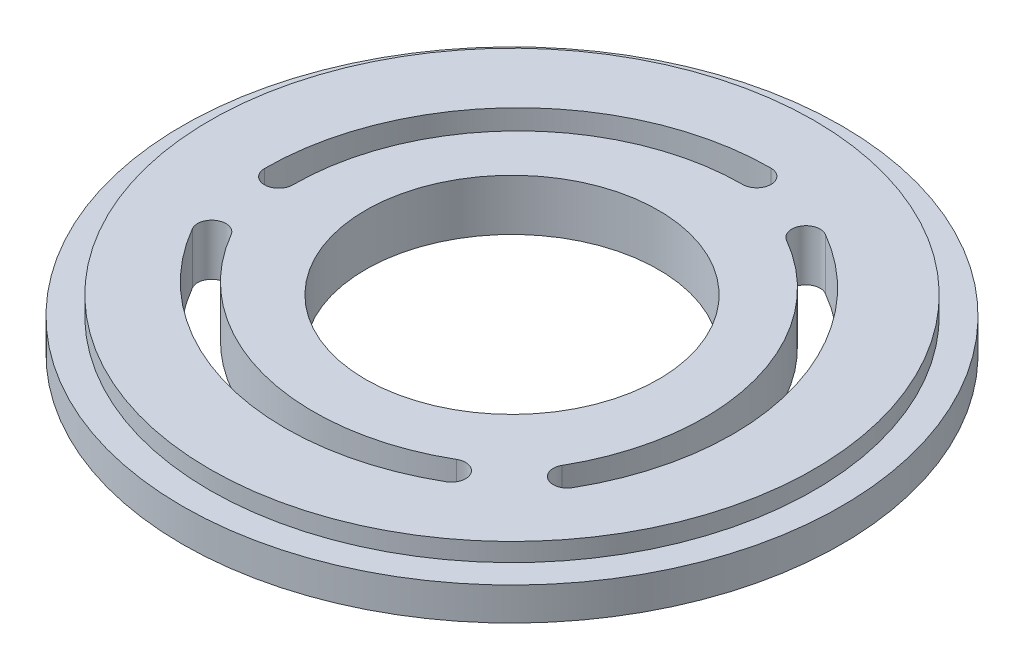
ISO-10303-21;
HEADER;
FILE_DESCRIPTION(('STEP AP214'),'2;1');
FILE_NAME('part.step','',(''),(''),'','','');
FILE_SCHEMA(('AUTOMOTIVE_DESIGN { 1 0 10303 214 1 1 1 1 }'));
ENDSEC;
DATA;
#1=APPLICATION_CONTEXT('core data for automotive mechanical design processes');
#2=APPLICATION_PROTOCOL_DEFINITION('international standard','automotive_design',2000,#1);
#3=PRODUCT_CONTEXT('',#1,'mechanical');
#4=PRODUCT('Part','Part','',(#3));
#5=PRODUCT_RELATED_PRODUCT_CATEGORY('part','',(#4));
#6=PRODUCT_DEFINITION_FORMATION('','',#4);
#7=PRODUCT_DEFINITION_CONTEXT('part definition',#1,'design');
#8=PRODUCT_DEFINITION('design','',#6,#7);
#9=PRODUCT_DEFINITION_SHAPE('','',#8);
#10=(LENGTH_UNIT() NAMED_UNIT(*) SI_UNIT(.MILLI.,.METRE.));
#11=(NAMED_UNIT(*) PLANE_ANGLE_UNIT() SI_UNIT($,.RADIAN.));
#12=(NAMED_UNIT(*) SI_UNIT($,.STERADIAN.) SOLID_ANGLE_UNIT());
#13=UNCERTAINTY_MEASURE_WITH_UNIT(LENGTH_MEASURE(1.E-05),#10,'distance_accuracy_value','');
#14=(GEOMETRIC_REPRESENTATION_CONTEXT(3) GLOBAL_UNCERTAINTY_ASSIGNED_CONTEXT((#13)) GLOBAL_UNIT_ASSIGNED_CONTEXT((#10,
#11,#12)) REPRESENTATION_CONTEXT('',''));
#15=CARTESIAN_POINT('',(0.,0.,0.));
#16=DIRECTION('',(0.,0.,1.));
#17=DIRECTION('',(1.,0.,0.));
#18=AXIS2_PLACEMENT_3D('',#15,#16,#17);
#19=CARTESIAN_POINT('',(0.,-1.8,0.));
#20=DIRECTION('',(0.,1.,0.));
#21=DIRECTION('',(0.,0.,1.));
#22=AXIS2_PLACEMENT_3D('',#19,#20,#21);
#23=CYLINDRICAL_SURFACE('',#22,18.);
#24=CARTESIAN_POINT('',(0.,-1.8,0.));
#25=DIRECTION('',(0.,1.,0.));
#26=DIRECTION('',(0.,0.,1.));
#27=AXIS2_PLACEMENT_3D('',#24,#25,#26);
#28=CIRCLE('',#27,18.);
#29=CARTESIAN_POINT('',(0.,-1.8,18.));
#30=VERTEX_POINT('',#29);
#31=EDGE_CURVE('E52',#30,#30,#28,.T.);
#32=ORIENTED_EDGE('',*,*,#31,.T.);
#33=EDGE_LOOP('',(#32));
#34=FACE_BOUND('',#33,.T.);
#35=CARTESIAN_POINT('',(0.,0.,0.));
#36=DIRECTION('',(0.,1.,0.));
#37=DIRECTION('',(0.,0.,1.));
#38=AXIS2_PLACEMENT_3D('',#35,#36,#37);
#39=CIRCLE('',#38,18.);
#40=CARTESIAN_POINT('',(0.,0.,18.));
#41=VERTEX_POINT('',#40);
#42=EDGE_CURVE('E46',#41,#41,#39,.T.);
#43=ORIENTED_EDGE('',*,*,#42,.F.);
#44=EDGE_LOOP('',(#43));
#45=FACE_BOUND('',#44,.T.);
#46=ADVANCED_FACE('F43',(#34,#45),#23,.T.);
#47=CARTESIAN_POINT('',(0.,-1.8,0.));
#48=DIRECTION('',(0.,1.,0.));
#49=DIRECTION('',(0.,0.,1.));
#50=AXIS2_PLACEMENT_3D('',#47,#48,#49);
#51=PLANE('',#50);
#52=CARTESIAN_POINT('',(-1.20958056797005,-1.8,0.567295138495359));
#53=DIRECTION('',(0.,1.,0.));
#54=DIRECTION('',(0.,0.,1.));
#55=AXIS2_PLACEMENT_3D('',#52,#53,#54);
#56=CIRCLE('',#55,12.2830345810914);
#57=CARTESIAN_POINT('',(4.91644636083585,-1.8,-10.0790531832454));
#58=VERTEX_POINT('',#57);
#59=CARTESIAN_POINT('',(9.43676775377074,-1.8,6.69332206730114));
#60=VERTEX_POINT('',#59);
#61=EDGE_CURVE('E259',#58,#60,#56,.F.);
#62=ORIENTED_EDGE('',*,*,#61,.T.);
#63=CARTESIAN_POINT('',(10.1080465638795,-1.8,7.07958334141947));
#64=DIRECTION('',(0.,1.,0.));
#65=DIRECTION('',(0.,0.,1.));
#66=AXIS2_PLACEMENT_3D('',#63,#64,#65);
#67=CIRCLE('',#66,0.774475960107598);
#68=CARTESIAN_POINT('',(10.7793253739883,-1.8,7.4658446155378));
#69=VERTEX_POINT('',#68);
#70=EDGE_CURVE('E263',#60,#69,#67,.T.);
#71=ORIENTED_EDGE('',*,*,#70,.T.);
#72=CARTESIAN_POINT('',(-1.20958056797005,-1.8,0.567295138495359));
#73=DIRECTION('',(0.,1.,0.));
#74=DIRECTION('',(0.,0.,1.));
#75=AXIS2_PLACEMENT_3D('',#72,#73,#74);
#76=CIRCLE('',#75,13.8319865013066);
#77=CARTESIAN_POINT('',(5.68896890907253,-1.8,-11.4216108034629));
#78=VERTEX_POINT('',#77);
#79=EDGE_CURVE('E251',#69,#78,#76,.T.);
#80=ORIENTED_EDGE('',*,*,#79,.T.);
#81=CARTESIAN_POINT('',(5.30270763495419,-1.8,-10.7503319933541));
#82=DIRECTION('',(0.,1.,0.));
#83=DIRECTION('',(0.,0.,1.));
#84=AXIS2_PLACEMENT_3D('',#81,#82,#83);
#85=CIRCLE('',#84,0.774475960107599);
#86=EDGE_CURVE('E255',#78,#58,#85,.T.);
#87=ORIENTED_EDGE('',*,*,#86,.T.);
#88=EDGE_LOOP('',(#62,#71,#80,#87));
#89=FACE_BOUND('',#88,.T.);
#90=CARTESIAN_POINT('',(0.113498282604641,-1.8,-1.33117506903375));
#91=DIRECTION('',(0.,1.,0.));
#92=DIRECTION('',(0.,0.,1.));
#93=AXIS2_PLACEMENT_3D('',#90,#91,#92);
#94=CIRCLE('',#93,12.2830345810914);
#95=CARTESIAN_POINT('',(6.27049292236693,-1.8,9.29729403645011));
#96=VERTEX_POINT('',#95);
#97=CARTESIAN_POINT('',(-10.5149708228792,-1.8,4.82581957072865));
#98=VERTEX_POINT('',#97);
#99=EDGE_CURVE('E246',#96,#98,#94,.F.);
#100=ORIENTED_EDGE('',*,*,#99,.T.);
#101=CARTESIAN_POINT('',(-11.1851223038182,-1.8,5.21403343624589));
#102=DIRECTION('',(0.,1.,0.));
#103=DIRECTION('',(0.,0.,1.));
#104=AXIS2_PLACEMENT_3D('',#101,#102,#103);
#105=CIRCLE('',#104,0.774475960107598);
#106=CARTESIAN_POINT('',(-11.8552737847572,-1.8,5.60224730176312));
#107=VERTEX_POINT('',#106);
#108=EDGE_CURVE('E141',#98,#107,#105,.T.);
#109=ORIENTED_EDGE('',*,*,#108,.T.);
#110=CARTESIAN_POINT('',(0.113498282604641,-1.8,-1.33117506903375));
#111=DIRECTION('',(0.,1.,0.));
#112=DIRECTION('',(0.,0.,1.));
#113=AXIS2_PLACEMENT_3D('',#110,#111,#112);
#114=CIRCLE('',#113,13.8319865013066);
#115=CARTESIAN_POINT('',(7.04692065340138,-1.8,10.6375969983281));
#116=VERTEX_POINT('',#115);
#117=EDGE_CURVE('E238',#107,#116,#114,.T.);
#118=ORIENTED_EDGE('',*,*,#117,.T.);
#119=CARTESIAN_POINT('',(6.65870678788415,-1.8,9.96744551738913));
#120=DIRECTION('',(0.,1.,0.));
#121=DIRECTION('',(0.,0.,1.));
#122=AXIS2_PLACEMENT_3D('',#119,#120,#121);
#123=CIRCLE('',#122,0.774475960107599);
#124=EDGE_CURVE('E242',#116,#96,#123,.T.);
#125=ORIENTED_EDGE('',*,*,#124,.T.);
#126=EDGE_LOOP('',(#100,#109,#118,#125));
#127=FACE_BOUND('',#126,.T.);
#128=CARTESIAN_POINT('',(1.09608228536542,-1.8,0.763879930538391));
#129=DIRECTION('',(0.,1.,0.));
#130=DIRECTION('',(0.,0.,1.));
#131=AXIS2_PLACEMENT_3D('',#128,#129,#130);
#132=CIRCLE('',#131,12.2830345810914);
#133=CARTESIAN_POINT('',(-11.1869392832028,-1.8,0.78175914679533));
#134=VERTEX_POINT('',#133);
#135=CARTESIAN_POINT('',(1.07820306910834,-1.8,-11.5191416380298));
#136=VERTEX_POINT('',#135);
#137=EDGE_CURVE('E230',#134,#136,#132,.F.);
#138=ORIENTED_EDGE('',*,*,#137,.T.);
#139=CARTESIAN_POINT('',(1.07707573993856,-1.8,-12.2936167776654));
#140=DIRECTION('',(0.,1.,0.));
#141=DIRECTION('',(0.,0.,1.));
#142=AXIS2_PLACEMENT_3D('',#139,#140,#141);
#143=CIRCLE('',#142,0.774475960107599);
#144=CARTESIAN_POINT('',(1.07594841076878,-1.8,-13.068091917301));
#145=VERTEX_POINT('',#144);
#146=EDGE_CURVE('E234',#136,#145,#143,.T.);
#147=ORIENTED_EDGE('',*,*,#146,.T.);
#148=CARTESIAN_POINT('',(1.09608228536542,-1.8,0.763879930538391));
#149=DIRECTION('',(0.,1.,0.));
#150=DIRECTION('',(0.,0.,1.));
#151=AXIS2_PLACEMENT_3D('',#148,#149,#150);
#152=CIRCLE('',#151,13.8319865013066);
#153=CARTESIAN_POINT('',(-12.735889562474,-1.8,0.784013805134867));
#154=VERTEX_POINT('',#153);
#155=EDGE_CURVE('E213',#145,#154,#152,.T.);
#156=ORIENTED_EDGE('',*,*,#155,.T.);
#157=CARTESIAN_POINT('',(-11.9614144228384,-1.8,0.782886475965101));
#158=DIRECTION('',(0.,1.,0.));
#159=DIRECTION('',(0.,0.,1.));
#160=AXIS2_PLACEMENT_3D('',#157,#158,#159);
#161=CIRCLE('',#160,0.774475960107599);
#162=EDGE_CURVE('E226',#154,#134,#161,.T.);
#163=ORIENTED_EDGE('',*,*,#162,.T.);
#164=EDGE_LOOP('',(#138,#147,#156,#163));
#165=FACE_BOUND('',#164,.T.);
#166=CARTESIAN_POINT('',(0.,-1.8,0.));
#167=DIRECTION('',(0.,1.,0.));
#168=DIRECTION('',(0.,0.,1.));
#169=AXIS2_PLACEMENT_3D('',#166,#167,#168);
#170=CIRCLE('',#169,8.);
#171=CARTESIAN_POINT('',(0.,-1.8,8.));
#172=VERTEX_POINT('',#171);
#173=EDGE_CURVE('E271',#172,#172,#170,.T.);
#174=ORIENTED_EDGE('',*,*,#173,.T.);
#175=EDGE_LOOP('',(#174));
#176=FACE_BOUND('',#175,.T.);
#177=ORIENTED_EDGE('',*,*,#31,.F.);
#178=EDGE_LOOP('',(#177));
#179=FACE_BOUND('',#178,.T.);
#180=ADVANCED_FACE('F289',(#89,#127,#165,#176,#179),#51,.F.);
#181=CARTESIAN_POINT('',(0.,0.,0.));
#182=DIRECTION('',(0.,1.,0.));
#183=DIRECTION('',(0.,0.,1.));
#184=AXIS2_PLACEMENT_3D('',#181,#182,#183);
#185=PLANE('',#184);
#186=CARTESIAN_POINT('',(0.,0.,0.));
#187=DIRECTION('',(0.,1.,0.));
#188=DIRECTION('',(0.,0.,1.));
#189=AXIS2_PLACEMENT_3D('',#186,#187,#188);
#190=CIRCLE('',#189,16.5);
#191=CARTESIAN_POINT('',(0.,0.,16.5));
#192=VERTEX_POINT('',#191);
#193=EDGE_CURVE('E11',#192,#192,#190,.T.);
#194=ORIENTED_EDGE('',*,*,#193,.F.);
#195=EDGE_LOOP('',(#194));
#196=FACE_BOUND('',#195,.T.);
#197=ORIENTED_EDGE('',*,*,#42,.T.);
#198=EDGE_LOOP('',(#197));
#199=FACE_BOUND('',#198,.T.);
#200=ADVANCED_FACE('F286',(#196,#199),#185,.T.);
#201=CARTESIAN_POINT('',(0.,1.,0.));
#202=DIRECTION('',(0.,-1.,0.));
#203=DIRECTION('',(0.,0.,-1.));
#204=AXIS2_PLACEMENT_3D('',#201,#202,#203);
#205=CYLINDRICAL_SURFACE('',#204,16.5);
#206=CARTESIAN_POINT('',(0.,1.,0.));
#207=DIRECTION('',(0.,1.,0.));
#208=DIRECTION('',(0.,0.,1.));
#209=AXIS2_PLACEMENT_3D('',#206,#207,#208);
#210=CIRCLE('',#209,16.5);
#211=CARTESIAN_POINT('',(0.,1.,16.5));
#212=VERTEX_POINT('',#211);
#213=EDGE_CURVE('E275',#212,#212,#210,.T.);
#214=ORIENTED_EDGE('',*,*,#213,.F.);
#215=EDGE_LOOP('',(#214));
#216=FACE_BOUND('',#215,.T.);
#217=ORIENTED_EDGE('',*,*,#193,.T.);
#218=EDGE_LOOP('',(#217));
#219=FACE_BOUND('',#218,.T.);
#220=ADVANCED_FACE('F298',(#216,#219),#205,.T.);
#221=CARTESIAN_POINT('',(0.,1.,0.));
#222=DIRECTION('',(0.,1.,0.));
#223=DIRECTION('',(0.,0.,1.));
#224=AXIS2_PLACEMENT_3D('',#221,#222,#223);
#225=PLANE('',#224);
#226=CARTESIAN_POINT('',(10.1080465638795,1.,7.07958334141947));
#227=DIRECTION('',(0.,1.,0.));
#228=DIRECTION('',(0.,0.,1.));
#229=AXIS2_PLACEMENT_3D('',#226,#227,#228);
#230=CIRCLE('',#229,0.774475960107598);
#231=CARTESIAN_POINT('',(9.43676775377074,1.,6.69332206730114));
#232=VERTEX_POINT('',#231);
#233=CARTESIAN_POINT('',(10.7793253739883,1.,7.4658446155378));
#234=VERTEX_POINT('',#233);
#235=EDGE_CURVE('E191',#232,#234,#230,.T.);
#236=ORIENTED_EDGE('',*,*,#235,.F.);
#237=CARTESIAN_POINT('',(-1.20958056797005,1.,0.567295138495359));
#238=DIRECTION('',(0.,-1.,0.));
#239=DIRECTION('',(0.,0.,1.));
#240=AXIS2_PLACEMENT_3D('',#237,#238,#239);
#241=CIRCLE('',#240,12.2830345810914);
#242=CARTESIAN_POINT('',(4.91644636083585,1.,-10.0790531832454));
#243=VERTEX_POINT('',#242);
#244=EDGE_CURVE('E176',#243,#232,#241,.T.);
#245=ORIENTED_EDGE('',*,*,#244,.F.);
#246=CARTESIAN_POINT('',(5.30270763495419,1.,-10.7503319933541));
#247=DIRECTION('',(0.,1.,0.));
#248=DIRECTION('',(0.,0.,1.));
#249=AXIS2_PLACEMENT_3D('',#246,#247,#248);
#250=CIRCLE('',#249,0.774475960107599);
#251=CARTESIAN_POINT('',(5.68896890907253,1.,-11.4216108034629));
#252=VERTEX_POINT('',#251);
#253=EDGE_CURVE('E184',#252,#243,#250,.T.);
#254=ORIENTED_EDGE('',*,*,#253,.F.);
#255=CARTESIAN_POINT('',(-1.20958056797005,1.,0.567295138495359));
#256=DIRECTION('',(0.,1.,0.));
#257=DIRECTION('',(0.,0.,1.));
#258=AXIS2_PLACEMENT_3D('',#255,#256,#257);
#259=CIRCLE('',#258,13.8319865013066);
#260=EDGE_CURVE('E188',#234,#252,#259,.T.);
#261=ORIENTED_EDGE('',*,*,#260,.F.);
#262=EDGE_LOOP('',(#236,#245,#254,#261));
#263=FACE_BOUND('',#262,.T.);
#264=CARTESIAN_POINT('',(-11.1851223038182,1.,5.21403343624589));
#265=DIRECTION('',(0.,1.,0.));
#266=DIRECTION('',(0.,0.,1.));
#267=AXIS2_PLACEMENT_3D('',#264,#265,#266);
#268=CIRCLE('',#267,0.774475960107598);
#269=CARTESIAN_POINT('',(-10.5149708228792,1.,4.82581957072865));
#270=VERTEX_POINT('',#269);
#271=CARTESIAN_POINT('',(-11.8552737847572,1.,5.60224730176312));
#272=VERTEX_POINT('',#271);
#273=EDGE_CURVE('E138',#270,#272,#268,.T.);
#274=ORIENTED_EDGE('',*,*,#273,.F.);
#275=CARTESIAN_POINT('',(0.113498282604641,1.,-1.33117506903375));
#276=DIRECTION('',(0.,-1.,0.));
#277=DIRECTION('',(0.,0.,1.));
#278=AXIS2_PLACEMENT_3D('',#275,#276,#277);
#279=CIRCLE('',#278,12.2830345810914);
#280=CARTESIAN_POINT('',(6.27049292236693,1.,9.29729403645011));
#281=VERTEX_POINT('',#280);
#282=EDGE_CURVE('E148',#281,#270,#279,.T.);
#283=ORIENTED_EDGE('',*,*,#282,.F.);
#284=CARTESIAN_POINT('',(6.65870678788415,1.,9.96744551738913));
#285=DIRECTION('',(0.,1.,0.));
#286=DIRECTION('',(0.,0.,1.));
#287=AXIS2_PLACEMENT_3D('',#284,#285,#286);
#288=CIRCLE('',#287,0.774475960107599);
#289=CARTESIAN_POINT('',(7.04692065340138,1.,10.6375969983281));
#290=VERTEX_POINT('',#289);
#291=EDGE_CURVE('E155',#290,#281,#288,.T.);
#292=ORIENTED_EDGE('',*,*,#291,.F.);
#293=CARTESIAN_POINT('',(0.113498282604641,1.,-1.33117506903375));
#294=DIRECTION('',(0.,1.,0.));
#295=DIRECTION('',(0.,0.,1.));
#296=AXIS2_PLACEMENT_3D('',#293,#294,#295);
#297=CIRCLE('',#296,13.8319865013066);
#298=EDGE_CURVE('E161',#272,#290,#297,.T.);
#299=ORIENTED_EDGE('',*,*,#298,.F.);
#300=EDGE_LOOP('',(#274,#283,#292,#299));
#301=FACE_BOUND('',#300,.T.);
#302=CARTESIAN_POINT('',(1.07707573993856,1.,-12.2936167776654));
#303=DIRECTION('',(0.,1.,0.));
#304=DIRECTION('',(0.,0.,1.));
#305=AXIS2_PLACEMENT_3D('',#302,#303,#304);
#306=CIRCLE('',#305,0.774475960107599);
#307=CARTESIAN_POINT('',(1.07820306910834,1.,-11.5191416380298));
#308=VERTEX_POINT('',#307);
#309=CARTESIAN_POINT('',(1.07594841076878,1.,-13.068091917301));
#310=VERTEX_POINT('',#309);
#311=EDGE_CURVE('E194',#308,#310,#306,.T.);
#312=ORIENTED_EDGE('',*,*,#311,.F.);
#313=CARTESIAN_POINT('',(1.09608228536542,1.,0.763879930538391));
#314=DIRECTION('',(0.,-1.,0.));
#315=DIRECTION('',(0.,0.,1.));
#316=AXIS2_PLACEMENT_3D('',#313,#314,#315);
#317=CIRCLE('',#316,12.2830345810914);
#318=CARTESIAN_POINT('',(-11.1869392832028,1.,0.78175914679533));
#319=VERTEX_POINT('',#318);
#320=EDGE_CURVE('E205',#319,#308,#317,.T.);
#321=ORIENTED_EDGE('',*,*,#320,.F.);
#322=CARTESIAN_POINT('',(-11.9614144228384,1.,0.782886475965101));
#323=DIRECTION('',(0.,1.,0.));
#324=DIRECTION('',(0.,0.,1.));
#325=AXIS2_PLACEMENT_3D('',#322,#323,#324);
#326=CIRCLE('',#325,0.774475960107599);
#327=CARTESIAN_POINT('',(-12.735889562474,1.,0.784013805134867));
#328=VERTEX_POINT('',#327);
#329=EDGE_CURVE('E201',#328,#319,#326,.T.);
#330=ORIENTED_EDGE('',*,*,#329,.F.);
#331=CARTESIAN_POINT('',(1.09608228536542,1.,0.763879930538391));
#332=DIRECTION('',(0.,1.,0.));
#333=DIRECTION('',(0.,0.,1.));
#334=AXIS2_PLACEMENT_3D('',#331,#332,#333);
#335=CIRCLE('',#334,13.8319865013066);
#336=EDGE_CURVE('E197',#310,#328,#335,.T.);
#337=ORIENTED_EDGE('',*,*,#336,.F.);
#338=EDGE_LOOP('',(#312,#321,#330,#337));
#339=FACE_BOUND('',#338,.T.);
#340=CARTESIAN_POINT('',(0.,1.,0.));
#341=DIRECTION('',(0.,1.,0.));
#342=DIRECTION('',(0.,0.,1.));
#343=AXIS2_PLACEMENT_3D('',#340,#341,#342);
#344=CIRCLE('',#343,8.);
#345=CARTESIAN_POINT('',(0.,1.,8.));
#346=VERTEX_POINT('',#345);
#347=EDGE_CURVE('E267',#346,#346,#344,.T.);
#348=ORIENTED_EDGE('',*,*,#347,.F.);
#349=EDGE_LOOP('',(#348));
#350=FACE_BOUND('',#349,.T.);
#351=ORIENTED_EDGE('',*,*,#213,.T.);
#352=EDGE_LOOP('',(#351));
#353=FACE_BOUND('',#352,.T.);
#354=ADVANCED_FACE('F159',(#263,#301,#339,#350,#353),#225,.T.);
#355=CARTESIAN_POINT('',(0.,-4.,0.));
#356=DIRECTION('',(0.,1.,0.));
#357=DIRECTION('',(0.,0.,1.));
#358=AXIS2_PLACEMENT_3D('',#355,#356,#357);
#359=CYLINDRICAL_SURFACE('',#358,8.);
#360=ORIENTED_EDGE('',*,*,#347,.T.);
#361=EDGE_LOOP('',(#360));
#362=FACE_BOUND('',#361,.T.);
#363=ORIENTED_EDGE('',*,*,#173,.F.);
#364=EDGE_LOOP('',(#363));
#365=FACE_BOUND('',#364,.T.);
#366=ADVANCED_FACE('F307',(#362,#365),#359,.F.);
#367=CARTESIAN_POINT('',(1.07707573993856,-4.,-12.2936167776654));
#368=DIRECTION('',(0.,1.,0.));
#369=DIRECTION('',(0.,0.,1.));
#370=AXIS2_PLACEMENT_3D('',#367,#368,#369);
#371=CYLINDRICAL_SURFACE('',#370,0.774475960107599);
#372=DIRECTION('',(0.,1.,0.));
#373=VECTOR('',#372,1.);
#374=CARTESIAN_POINT('',(1.07820306910834,-4.,-11.5191416380298));
#375=LINE('',#374,#373);
#376=EDGE_CURVE('E210',#136,#308,#375,.T.);
#377=ORIENTED_EDGE('',*,*,#376,.T.);
#378=ORIENTED_EDGE('',*,*,#311,.T.);
#379=DIRECTION('',(0.,1.,0.));
#380=VECTOR('',#379,1.);
#381=CARTESIAN_POINT('',(1.07594841076878,-4.,-13.068091917301));
#382=LINE('',#381,#380);
#383=EDGE_CURVE('E209',#145,#310,#382,.T.);
#384=ORIENTED_EDGE('',*,*,#383,.F.);
#385=ORIENTED_EDGE('',*,*,#146,.F.);
#386=EDGE_LOOP('',(#377,#378,#384,#385));
#387=FACE_BOUND('',#386,.T.);
#388=ADVANCED_FACE('F311',(#387),#371,.F.);
#389=CARTESIAN_POINT('',(1.09608228536542,-4.,0.763879930538391));
#390=DIRECTION('',(0.,1.,0.));
#391=DIRECTION('',(0.,0.,1.));
#392=AXIS2_PLACEMENT_3D('',#389,#390,#391);
#393=CYLINDRICAL_SURFACE('',#392,12.2830345810914);
#394=DIRECTION('',(0.,1.,0.));
#395=VECTOR('',#394,1.);
#396=CARTESIAN_POINT('',(-11.1869392832028,-4.,0.78175914679533));
#397=LINE('',#396,#395);
#398=EDGE_CURVE('E214',#134,#319,#397,.T.);
#399=ORIENTED_EDGE('',*,*,#398,.T.);
#400=ORIENTED_EDGE('',*,*,#320,.T.);
#401=ORIENTED_EDGE('',*,*,#376,.F.);
#402=ORIENTED_EDGE('',*,*,#137,.F.);
#403=EDGE_LOOP('',(#399,#400,#401,#402));
#404=FACE_BOUND('',#403,.T.);
#405=ADVANCED_FACE('F315',(#404),#393,.T.);
#406=CARTESIAN_POINT('',(-11.9614144228384,-4.,0.782886475965101));
#407=DIRECTION('',(0.,1.,0.));
#408=DIRECTION('',(0.,0.,1.));
#409=AXIS2_PLACEMENT_3D('',#406,#407,#408);
#410=CYLINDRICAL_SURFACE('',#409,0.774475960107599);
#411=DIRECTION('',(0.,1.,0.));
#412=VECTOR('',#411,1.);
#413=CARTESIAN_POINT('',(-12.735889562474,-4.,0.784013805134867));
#414=LINE('',#413,#412);
#415=EDGE_CURVE('E217',#154,#328,#414,.T.);
#416=ORIENTED_EDGE('',*,*,#415,.T.);
#417=ORIENTED_EDGE('',*,*,#329,.T.);
#418=ORIENTED_EDGE('',*,*,#398,.F.);
#419=ORIENTED_EDGE('',*,*,#162,.F.);
#420=EDGE_LOOP('',(#416,#417,#418,#419));
#421=FACE_BOUND('',#420,.T.);
#422=ADVANCED_FACE('F320',(#421),#410,.F.);
#423=CARTESIAN_POINT('',(1.09608228536542,-4.,0.763879930538391));
#424=DIRECTION('',(0.,1.,0.));
#425=DIRECTION('',(0.,0.,1.));
#426=AXIS2_PLACEMENT_3D('',#423,#424,#425);
#427=CYLINDRICAL_SURFACE('',#426,13.8319865013066);
#428=ORIENTED_EDGE('',*,*,#383,.T.);
#429=ORIENTED_EDGE('',*,*,#336,.T.);
#430=ORIENTED_EDGE('',*,*,#415,.F.);
#431=ORIENTED_EDGE('',*,*,#155,.F.);
#432=EDGE_LOOP('',(#428,#429,#430,#431));
#433=FACE_BOUND('',#432,.T.);
#434=ADVANCED_FACE('F317',(#433),#427,.F.);
#435=CARTESIAN_POINT('',(-11.1851223038182,-4.,5.21403343624589));
#436=DIRECTION('',(0.,1.,0.));
#437=DIRECTION('',(0.,0.,1.));
#438=AXIS2_PLACEMENT_3D('',#435,#436,#437);
#439=CYLINDRICAL_SURFACE('',#438,0.774475960107598);
#440=DIRECTION('',(0.,1.,0.));
#441=VECTOR('',#440,1.);
#442=CARTESIAN_POINT('',(-10.5149708228792,-4.,4.82581957072865));
#443=LINE('',#442,#441);
#444=EDGE_CURVE('E133',#98,#270,#443,.T.);
#445=ORIENTED_EDGE('',*,*,#444,.T.);
#446=ORIENTED_EDGE('',*,*,#273,.T.);
#447=DIRECTION('',(0.,1.,0.));
#448=VECTOR('',#447,1.);
#449=CARTESIAN_POINT('',(-11.8552737847572,-4.,5.60224730176312));
#450=LINE('',#449,#448);
#451=EDGE_CURVE('E156',#107,#272,#450,.T.);
#452=ORIENTED_EDGE('',*,*,#451,.F.);
#453=ORIENTED_EDGE('',*,*,#108,.F.);
#454=EDGE_LOOP('',(#445,#446,#452,#453));
#455=FACE_BOUND('',#454,.T.);
#456=ADVANCED_FACE('F135',(#455),#439,.F.);
#457=CARTESIAN_POINT('',(0.113498282604641,-4.,-1.33117506903375));
#458=DIRECTION('',(0.,1.,0.));
#459=DIRECTION('',(0.,0.,1.));
#460=AXIS2_PLACEMENT_3D('',#457,#458,#459);
#461=CYLINDRICAL_SURFACE('',#460,12.2830345810914);
#462=DIRECTION('',(0.,1.,0.));
#463=VECTOR('',#462,1.);
#464=CARTESIAN_POINT('',(6.27049292236693,-4.,9.29729403645011));
#465=LINE('',#464,#463);
#466=EDGE_CURVE('E145',#96,#281,#465,.T.);
#467=ORIENTED_EDGE('',*,*,#466,.T.);
#468=ORIENTED_EDGE('',*,*,#282,.T.);
#469=ORIENTED_EDGE('',*,*,#444,.F.);
#470=ORIENTED_EDGE('',*,*,#99,.F.);
#471=EDGE_LOOP('',(#467,#468,#469,#470));
#472=FACE_BOUND('',#471,.T.);
#473=ADVANCED_FACE('F149',(#472),#461,.T.);
#474=CARTESIAN_POINT('',(6.65870678788415,-4.,9.96744551738913));
#475=DIRECTION('',(0.,1.,0.));
#476=DIRECTION('',(0.,0.,1.));
#477=AXIS2_PLACEMENT_3D('',#474,#475,#476);
#478=CYLINDRICAL_SURFACE('',#477,0.774475960107599);
#479=DIRECTION('',(0.,1.,0.));
#480=VECTOR('',#479,1.);
#481=CARTESIAN_POINT('',(7.04692065340138,-4.,10.6375969983281));
#482=LINE('',#481,#480);
#483=EDGE_CURVE('E68',#116,#290,#482,.T.);
#484=ORIENTED_EDGE('',*,*,#483,.T.);
#485=ORIENTED_EDGE('',*,*,#291,.T.);
#486=ORIENTED_EDGE('',*,*,#466,.F.);
#487=ORIENTED_EDGE('',*,*,#124,.F.);
#488=EDGE_LOOP('',(#484,#485,#486,#487));
#489=FACE_BOUND('',#488,.T.);
#490=ADVANCED_FACE('F346',(#489),#478,.F.);
#491=CARTESIAN_POINT('',(0.113498282604641,-4.,-1.33117506903375));
#492=DIRECTION('',(0.,1.,0.));
#493=DIRECTION('',(0.,0.,1.));
#494=AXIS2_PLACEMENT_3D('',#491,#492,#493);
#495=CYLINDRICAL_SURFACE('',#494,13.8319865013066);
#496=ORIENTED_EDGE('',*,*,#451,.T.);
#497=ORIENTED_EDGE('',*,*,#298,.T.);
#498=ORIENTED_EDGE('',*,*,#483,.F.);
#499=ORIENTED_EDGE('',*,*,#117,.F.);
#500=EDGE_LOOP('',(#496,#497,#498,#499));
#501=FACE_BOUND('',#500,.T.);
#502=ADVANCED_FACE('F342',(#501),#495,.F.);
#503=CARTESIAN_POINT('',(10.1080465638795,-4.,7.07958334141947));
#504=DIRECTION('',(0.,1.,0.));
#505=DIRECTION('',(0.,0.,1.));
#506=AXIS2_PLACEMENT_3D('',#503,#504,#505);
#507=CYLINDRICAL_SURFACE('',#506,0.774475960107598);
#508=DIRECTION('',(0.,1.,0.));
#509=VECTOR('',#508,1.);
#510=CARTESIAN_POINT('',(9.43676775377074,-4.,6.69332206730114));
#511=LINE('',#510,#509);
#512=EDGE_CURVE('E163',#60,#232,#511,.T.);
#513=ORIENTED_EDGE('',*,*,#512,.T.);
#514=ORIENTED_EDGE('',*,*,#235,.T.);
#515=DIRECTION('',(0.,1.,0.));
#516=VECTOR('',#515,1.);
#517=CARTESIAN_POINT('',(10.7793253739883,-4.,7.4658446155378));
#518=LINE('',#517,#516);
#519=EDGE_CURVE('E172',#69,#234,#518,.T.);
#520=ORIENTED_EDGE('',*,*,#519,.F.);
#521=ORIENTED_EDGE('',*,*,#70,.F.);
#522=EDGE_LOOP('',(#513,#514,#520,#521));
#523=FACE_BOUND('',#522,.T.);
#524=ADVANCED_FACE('F332',(#523),#507,.F.);
#525=CARTESIAN_POINT('',(-1.20958056797005,-4.,0.567295138495359));
#526=DIRECTION('',(0.,1.,0.));
#527=DIRECTION('',(0.,0.,1.));
#528=AXIS2_PLACEMENT_3D('',#525,#526,#527);
#529=CYLINDRICAL_SURFACE('',#528,12.2830345810914);
#530=DIRECTION('',(0.,1.,0.));
#531=VECTOR('',#530,1.);
#532=CARTESIAN_POINT('',(4.91644636083585,-4.,-10.0790531832454));
#533=LINE('',#532,#531);
#534=EDGE_CURVE('E167',#58,#243,#533,.T.);
#535=ORIENTED_EDGE('',*,*,#534,.T.);
#536=ORIENTED_EDGE('',*,*,#244,.T.);
#537=ORIENTED_EDGE('',*,*,#512,.F.);
#538=ORIENTED_EDGE('',*,*,#61,.F.);
#539=EDGE_LOOP('',(#535,#536,#537,#538));
#540=FACE_BOUND('',#539,.T.);
#541=ADVANCED_FACE('F328',(#540),#529,.T.);
#542=CARTESIAN_POINT('',(5.30270763495419,-4.,-10.7503319933541));
#543=DIRECTION('',(0.,1.,0.));
#544=DIRECTION('',(0.,0.,1.));
#545=AXIS2_PLACEMENT_3D('',#542,#543,#544);
#546=CYLINDRICAL_SURFACE('',#545,0.774475960107599);
#547=DIRECTION('',(0.,1.,0.));
#548=VECTOR('',#547,1.);
#549=CARTESIAN_POINT('',(5.68896890907253,-4.,-11.4216108034629));
#550=LINE('',#549,#548);
#551=EDGE_CURVE('E60',#78,#252,#550,.T.);
#552=ORIENTED_EDGE('',*,*,#551,.T.);
#553=ORIENTED_EDGE('',*,*,#253,.T.);
#554=ORIENTED_EDGE('',*,*,#534,.F.);
#555=ORIENTED_EDGE('',*,*,#86,.F.);
#556=EDGE_LOOP('',(#552,#553,#554,#555));
#557=FACE_BOUND('',#556,.T.);
#558=ADVANCED_FACE('F331',(#557),#546,.F.);
#559=CARTESIAN_POINT('',(-1.20958056797005,-4.,0.567295138495359));
#560=DIRECTION('',(0.,1.,0.));
#561=DIRECTION('',(0.,0.,1.));
#562=AXIS2_PLACEMENT_3D('',#559,#560,#561);
#563=CYLINDRICAL_SURFACE('',#562,13.8319865013066);
#564=ORIENTED_EDGE('',*,*,#519,.T.);
#565=ORIENTED_EDGE('',*,*,#260,.T.);
#566=ORIENTED_EDGE('',*,*,#551,.F.);
#567=ORIENTED_EDGE('',*,*,#79,.F.);
#568=EDGE_LOOP('',(#564,#565,#566,#567));
#569=FACE_BOUND('',#568,.T.);
#570=ADVANCED_FACE('F336',(#569),#563,.F.);
#571=CLOSED_SHELL('',(#46,#180,#200,#220,#354,#366,#388,#405,#422,#434,#456,#473,#490,#502,#524,
#541,#558,#570));
#572=MANIFOLD_SOLID_BREP('B2',#571);
#573=ADVANCED_BREP_SHAPE_REPRESENTATION('',(#18,#572),#14);
#574=SHAPE_DEFINITION_REPRESENTATION(#9,#573);
ENDSEC;
END-ISO-10303-21;
